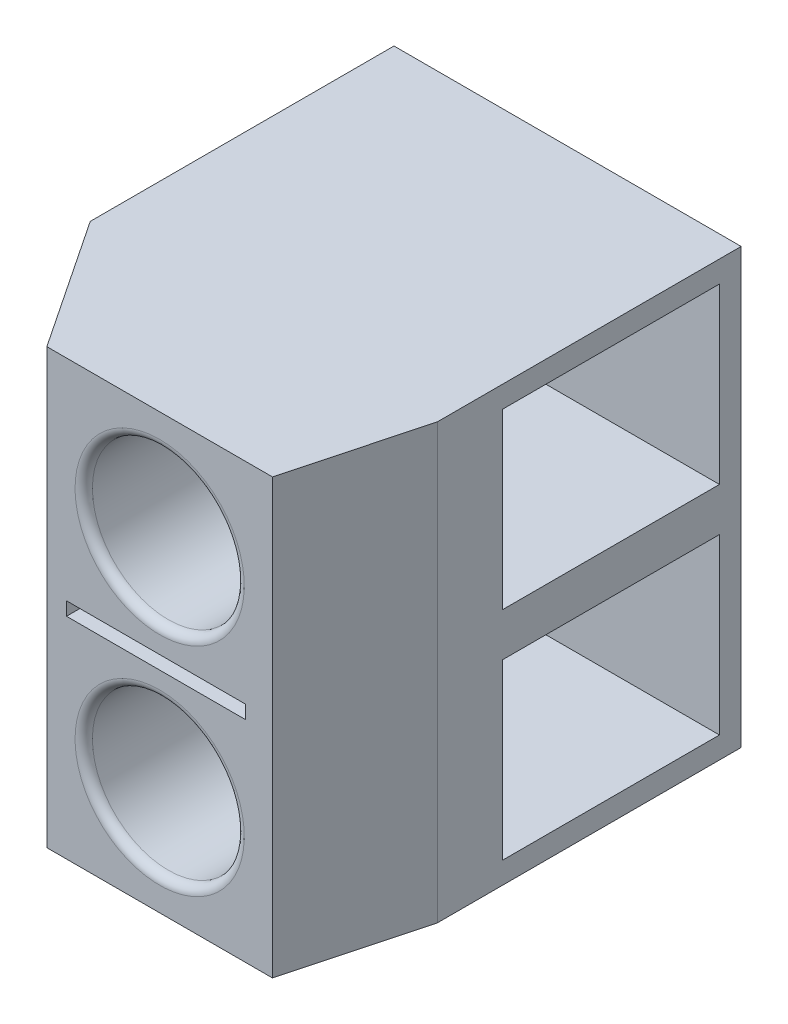
ISO-10303-21;
HEADER;
FILE_DESCRIPTION(('STEP AP214'),'2;1');
FILE_NAME('part.step','',(''),(''),'','','');
FILE_SCHEMA(('AUTOMOTIVE_DESIGN { 1 0 10303 214 1 1 1 1 }'));
ENDSEC;
DATA;
#1=APPLICATION_CONTEXT('core data for automotive mechanical design processes');
#2=APPLICATION_PROTOCOL_DEFINITION('international standard','automotive_design',2000,#1);
#3=PRODUCT_CONTEXT('',#1,'mechanical');
#4=PRODUCT('Part','Part','',(#3));
#5=PRODUCT_RELATED_PRODUCT_CATEGORY('part','',(#4));
#6=PRODUCT_DEFINITION_FORMATION('','',#4);
#7=PRODUCT_DEFINITION_CONTEXT('part definition',#1,'design');
#8=PRODUCT_DEFINITION('design','',#6,#7);
#9=PRODUCT_DEFINITION_SHAPE('','',#8);
#10=(LENGTH_UNIT() NAMED_UNIT(*) SI_UNIT(.MILLI.,.METRE.));
#11=(NAMED_UNIT(*) PLANE_ANGLE_UNIT() SI_UNIT($,.RADIAN.));
#12=(NAMED_UNIT(*) SI_UNIT($,.STERADIAN.) SOLID_ANGLE_UNIT());
#13=UNCERTAINTY_MEASURE_WITH_UNIT(LENGTH_MEASURE(1.E-05),#10,'distance_accuracy_value','');
#14=(GEOMETRIC_REPRESENTATION_CONTEXT(3) GLOBAL_UNCERTAINTY_ASSIGNED_CONTEXT((#13)) GLOBAL_UNIT_ASSIGNED_CONTEXT((#10,
#11,#12)) REPRESENTATION_CONTEXT('',''));
#15=CARTESIAN_POINT('',(0.,0.,0.));
#16=DIRECTION('',(0.,0.,1.));
#17=DIRECTION('',(1.,0.,0.));
#18=AXIS2_PLACEMENT_3D('',#15,#16,#17);
#19=CARTESIAN_POINT('',(6.57401180078,4.845554429064,-1.));
#20=DIRECTION('',(0.,0.,1.));
#21=DIRECTION('',(1.,0.,0.));
#22=AXIS2_PLACEMENT_3D('',#19,#20,#21);
#23=PLANE('',#22);
#24=DIRECTION('',(0.,1.,0.));
#25=VECTOR('',#24,1.);
#26=CARTESIAN_POINT('',(6.57401180078,4.845554429064,-1.));
#27=LINE('',#26,#25);
#28=CARTESIAN_POINT('',(6.57401180078,4.845554429064,-1.));
#29=VERTEX_POINT('',#28);
#30=CARTESIAN_POINT('',(6.57401180078,5.154445570936,-1.));
#31=VERTEX_POINT('',#30);
#32=EDGE_CURVE('E281',#29,#31,#27,.T.);
#33=ORIENTED_EDGE('',*,*,#32,.T.);
#34=DIRECTION('',(1.,0.,0.));
#35=VECTOR('',#34,1.);
#36=CARTESIAN_POINT('',(2.453062077991,5.154445570936,-1.));
#37=LINE('',#36,#35);
#38=CARTESIAN_POINT('',(2.453062077991,5.154445570936,-1.));
#39=VERTEX_POINT('',#38);
#40=EDGE_CURVE('E275',#31,#39,#37,.F.);
#41=ORIENTED_EDGE('',*,*,#40,.T.);
#42=DIRECTION('',(0.,1.,0.));
#43=VECTOR('',#42,1.);
#44=CARTESIAN_POINT('',(2.453062077991,5.154445570936,-1.));
#45=LINE('',#44,#43);
#46=CARTESIAN_POINT('',(2.453062077991,4.845554429064,-1.));
#47=VERTEX_POINT('',#46);
#48=EDGE_CURVE('E270',#39,#47,#45,.F.);
#49=ORIENTED_EDGE('',*,*,#48,.T.);
#50=DIRECTION('',(1.,0.,0.));
#51=VECTOR('',#50,1.);
#52=CARTESIAN_POINT('',(2.453062077991,4.845554429064,-1.));
#53=LINE('',#52,#51);
#54=EDGE_CURVE('E264',#47,#29,#53,.T.);
#55=ORIENTED_EDGE('',*,*,#54,.T.);
#56=EDGE_LOOP('',(#33,#41,#49,#55));
#57=FACE_BOUND('',#56,.T.);
#58=ADVANCED_FACE('F17',(#57),#23,.T.);
#59=CARTESIAN_POINT('',(4.6,7.5,-5.));
#60=DIRECTION('',(0.,0.,1.));
#61=DIRECTION('',(1.,0.,0.));
#62=AXIS2_PLACEMENT_3D('',#59,#60,#61);
#63=CYLINDRICAL_SURFACE('',#62,1.75);
#64=CARTESIAN_POINT('',(4.6,7.5,-0.2));
#65=DIRECTION('',(0.,0.,-1.));
#66=DIRECTION('',(0.,1.,0.));
#67=AXIS2_PLACEMENT_3D('',#64,#65,#66);
#68=CIRCLE('',#67,1.75);
#69=CARTESIAN_POINT('',(4.6,9.25,-0.2));
#70=VERTEX_POINT('',#69);
#71=EDGE_CURVE('E260',#70,#70,#68,.T.);
#72=ORIENTED_EDGE('',*,*,#71,.F.);
#73=EDGE_LOOP('',(#72));
#74=FACE_BOUND('',#73,.T.);
#75=CARTESIAN_POINT('',(4.6,7.5,-4.3));
#76=DIRECTION('',(0.,0.,1.));
#77=DIRECTION('',(1.,0.,0.));
#78=AXIS2_PLACEMENT_3D('',#75,#76,#77);
#79=CIRCLE('',#78,1.75);
#80=CARTESIAN_POINT('',(6.35,7.5,-4.3));
#81=VERTEX_POINT('',#80);
#82=EDGE_CURVE('E283',#81,#81,#79,.T.);
#83=ORIENTED_EDGE('',*,*,#82,.F.);
#84=EDGE_LOOP('',(#83));
#85=FACE_BOUND('',#84,.T.);
#86=ADVANCED_FACE('F722',(#74,#85),#63,.F.);
#87=CARTESIAN_POINT('',(4.6,2.5,-5.));
#88=DIRECTION('',(0.,0.,1.));
#89=DIRECTION('',(1.,0.,0.));
#90=AXIS2_PLACEMENT_3D('',#87,#88,#89);
#91=CYLINDRICAL_SURFACE('',#90,1.75);
#92=CARTESIAN_POINT('',(4.6,2.5,-0.2));
#93=DIRECTION('',(0.,0.,-1.));
#94=DIRECTION('',(0.,1.,0.));
#95=AXIS2_PLACEMENT_3D('',#92,#93,#94);
#96=CIRCLE('',#95,1.75);
#97=CARTESIAN_POINT('',(4.6,4.25,-0.2));
#98=VERTEX_POINT('',#97);
#99=EDGE_CURVE('E236',#98,#98,#96,.T.);
#100=ORIENTED_EDGE('',*,*,#99,.F.);
#101=EDGE_LOOP('',(#100));
#102=FACE_BOUND('',#101,.T.);
#103=CARTESIAN_POINT('',(4.6,2.5,-4.3));
#104=DIRECTION('',(0.,0.,1.));
#105=DIRECTION('',(1.,0.,0.));
#106=AXIS2_PLACEMENT_3D('',#103,#104,#105);
#107=CIRCLE('',#106,1.75);
#108=CARTESIAN_POINT('',(6.35,2.5,-4.3));
#109=VERTEX_POINT('',#108);
#110=EDGE_CURVE('E284',#109,#109,#107,.T.);
#111=ORIENTED_EDGE('',*,*,#110,.F.);
#112=EDGE_LOOP('',(#111));
#113=FACE_BOUND('',#112,.T.);
#114=ADVANCED_FACE('F713',(#102,#113),#91,.F.);
#115=CARTESIAN_POINT('',(4.6,7.5,-4.3));
#116=DIRECTION('',(0.,0.,1.));
#117=DIRECTION('',(1.,0.,0.));
#118=AXIS2_PLACEMENT_3D('',#115,#116,#117);
#119=TOROIDAL_SURFACE('',#118,1.95,0.200000000000001);
#120=ORIENTED_EDGE('',*,*,#82,.T.);
#121=EDGE_LOOP('',(#120));
#122=FACE_BOUND('',#121,.T.);
#123=CARTESIAN_POINT('',(4.6,7.5,-4.5));
#124=DIRECTION('',(0.,0.,1.));
#125=DIRECTION('',(1.,0.,0.));
#126=AXIS2_PLACEMENT_3D('',#123,#124,#125);
#127=CIRCLE('',#126,1.95);
#128=CARTESIAN_POINT('',(6.55,7.5,-4.5));
#129=VERTEX_POINT('',#128);
#130=EDGE_CURVE('E227',#129,#129,#127,.F.);
#131=ORIENTED_EDGE('',*,*,#130,.T.);
#132=EDGE_LOOP('',(#131));
#133=FACE_BOUND('',#132,.T.);
#134=ADVANCED_FACE('F704',(#122,#133),#119,.T.);
#135=CARTESIAN_POINT('',(4.6,2.5,-4.3));
#136=DIRECTION('',(0.,0.,1.));
#137=DIRECTION('',(1.,0.,0.));
#138=AXIS2_PLACEMENT_3D('',#135,#136,#137);
#139=TOROIDAL_SURFACE('',#138,1.95,0.2);
#140=ORIENTED_EDGE('',*,*,#110,.T.);
#141=EDGE_LOOP('',(#140));
#142=FACE_BOUND('',#141,.T.);
#143=CARTESIAN_POINT('',(4.6,2.5,-4.5));
#144=DIRECTION('',(0.,0.,1.));
#145=DIRECTION('',(1.,0.,0.));
#146=AXIS2_PLACEMENT_3D('',#143,#144,#145);
#147=CIRCLE('',#146,1.95);
#148=CARTESIAN_POINT('',(6.55,2.5,-4.5));
#149=VERTEX_POINT('',#148);
#150=EDGE_CURVE('E213',#149,#149,#147,.F.);
#151=ORIENTED_EDGE('',*,*,#150,.T.);
#152=EDGE_LOOP('',(#151));
#153=FACE_BOUND('',#152,.T.);
#154=ADVANCED_FACE('F695',(#142,#153),#139,.T.);
#155=CARTESIAN_POINT('',(1.7,7.5,-8.));
#156=DIRECTION('',(0.,0.,1.));
#157=DIRECTION('',(1.,0.,0.));
#158=AXIS2_PLACEMENT_3D('',#155,#156,#157);
#159=CYLINDRICAL_SURFACE('',#158,0.300785403025);
#160=CARTESIAN_POINT('',(1.7,7.5,-4.5));
#161=DIRECTION('',(0.,0.,1.));
#162=DIRECTION('',(1.,0.,0.));
#163=AXIS2_PLACEMENT_3D('',#160,#161,#162);
#164=CIRCLE('',#163,0.300785403025);
#165=CARTESIAN_POINT('',(2.000785403025,7.5,-4.5));
#166=VERTEX_POINT('',#165);
#167=EDGE_CURVE('E230',#166,#166,#164,.F.);
#168=ORIENTED_EDGE('',*,*,#167,.T.);
#169=EDGE_LOOP('',(#168));
#170=FACE_BOUND('',#169,.T.);
#171=CARTESIAN_POINT('',(1.7,7.5,-0.45000000000027));
#172=DIRECTION('',(0.832050294337997,0.,-0.554700196224998));
#173=DIRECTION('',(0.554700196224998,0.,0.832050294337998));
#174=AXIS2_PLACEMENT_3D('',#171,#172,#173);
#175=ELLIPSE('',#174,0.542248596759095,0.300785403025);
#176=CARTESIAN_POINT('',(2.,7.47827769181436,0.));
#177=VERTEX_POINT('',#176);
#178=CARTESIAN_POINT('',(2.,7.52172230818564,0.));
#179=VERTEX_POINT('',#178);
#180=EDGE_CURVE('E21',#177,#179,#175,.T.);
#181=ORIENTED_EDGE('',*,*,#180,.F.);
#182=CARTESIAN_POINT('',(1.7,7.5,0.));
#183=DIRECTION('',(0.,0.,1.));
#184=DIRECTION('',(1.,0.,0.));
#185=AXIS2_PLACEMENT_3D('',#182,#183,#184);
#186=CIRCLE('',#185,0.300785403025);
#187=EDGE_CURVE('E165',#177,#179,#186,.T.);
#188=ORIENTED_EDGE('',*,*,#187,.T.);
#189=EDGE_LOOP('',(#181,#188));
#190=FACE_BOUND('',#189,.T.);
#191=ADVANCED_FACE('F313',(#170,#190),#159,.F.);
#192=CARTESIAN_POINT('',(2.453062077991,5.154445570936,-1.));
#193=DIRECTION('',(0.,1.,0.));
#194=DIRECTION('',(0.,0.,1.));
#195=AXIS2_PLACEMENT_3D('',#192,#193,#194);
#196=PLANE('',#195);
#197=ORIENTED_EDGE('',*,*,#40,.F.);
#198=DIRECTION('',(0.,0.,-1.));
#199=VECTOR('',#198,1.);
#200=CARTESIAN_POINT('',(6.57401180078,5.154445570936,-1.));
#201=LINE('',#200,#199);
#202=CARTESIAN_POINT('',(6.57401180078,5.154445570936,0.));
#203=VERTEX_POINT('',#202);
#204=EDGE_CURVE('E257',#31,#203,#201,.F.);
#205=ORIENTED_EDGE('',*,*,#204,.T.);
#206=DIRECTION('',(-1.,0.,0.));
#207=VECTOR('',#206,1.);
#208=CARTESIAN_POINT('',(0.,5.154445570936,0.));
#209=LINE('',#208,#207);
#210=CARTESIAN_POINT('',(2.453062077991,5.154445570936,0.));
#211=VERTEX_POINT('',#210);
#212=EDGE_CURVE('E206',#203,#211,#209,.T.);
#213=ORIENTED_EDGE('',*,*,#212,.T.);
#214=DIRECTION('',(0.,0.,1.));
#215=VECTOR('',#214,1.);
#216=CARTESIAN_POINT('',(2.453062077991,5.154445570936,-1.));
#217=LINE('',#216,#215);
#218=EDGE_CURVE('E272',#211,#39,#217,.F.);
#219=ORIENTED_EDGE('',*,*,#218,.T.);
#220=EDGE_LOOP('',(#197,#205,#213,#219));
#221=FACE_BOUND('',#220,.T.);
#222=ADVANCED_FACE('F677',(#221),#196,.F.);
#223=CARTESIAN_POINT('',(2.453062077991,5.154445570936,-1.));
#224=DIRECTION('',(-1.,0.,0.));
#225=DIRECTION('',(0.,0.,1.));
#226=AXIS2_PLACEMENT_3D('',#223,#224,#225);
#227=PLANE('',#226);
#228=ORIENTED_EDGE('',*,*,#48,.F.);
#229=ORIENTED_EDGE('',*,*,#218,.F.);
#230=DIRECTION('',(0.,1.,0.));
#231=VECTOR('',#230,1.);
#232=CARTESIAN_POINT('',(2.453062077991,10.,0.));
#233=LINE('',#232,#231);
#234=CARTESIAN_POINT('',(2.453062077991,4.845554429064,0.));
#235=VERTEX_POINT('',#234);
#236=EDGE_CURVE('E203',#211,#235,#233,.F.);
#237=ORIENTED_EDGE('',*,*,#236,.T.);
#238=DIRECTION('',(0.,0.,-1.));
#239=VECTOR('',#238,1.);
#240=CARTESIAN_POINT('',(2.453062077991,4.845554429064,-1.));
#241=LINE('',#240,#239);
#242=EDGE_CURVE('E267',#235,#47,#241,.T.);
#243=ORIENTED_EDGE('',*,*,#242,.T.);
#244=EDGE_LOOP('',(#228,#229,#237,#243));
#245=FACE_BOUND('',#244,.T.);
#246=ADVANCED_FACE('F667',(#245),#227,.F.);
#247=CARTESIAN_POINT('',(2.453062077991,4.845554429064,-1.));
#248=DIRECTION('',(0.,-1.,0.));
#249=DIRECTION('',(0.,0.,-1.));
#250=AXIS2_PLACEMENT_3D('',#247,#248,#249);
#251=PLANE('',#250);
#252=ORIENTED_EDGE('',*,*,#54,.F.);
#253=ORIENTED_EDGE('',*,*,#242,.F.);
#254=DIRECTION('',(-1.,0.,0.));
#255=VECTOR('',#254,1.);
#256=CARTESIAN_POINT('',(0.,4.845554429064,0.));
#257=LINE('',#256,#255);
#258=CARTESIAN_POINT('',(6.57401180078,4.845554429064,0.));
#259=VERTEX_POINT('',#258);
#260=EDGE_CURVE('E200',#235,#259,#257,.F.);
#261=ORIENTED_EDGE('',*,*,#260,.T.);
#262=DIRECTION('',(0.,0.,-1.));
#263=VECTOR('',#262,1.);
#264=CARTESIAN_POINT('',(6.57401180078,4.845554429064,-1.));
#265=LINE('',#264,#263);
#266=EDGE_CURVE('E261',#259,#29,#265,.T.);
#267=ORIENTED_EDGE('',*,*,#266,.T.);
#268=EDGE_LOOP('',(#252,#253,#261,#267));
#269=FACE_BOUND('',#268,.T.);
#270=ADVANCED_FACE('F657',(#269),#251,.F.);
#271=CARTESIAN_POINT('',(6.57401180078,5.154445570936,-1.));
#272=DIRECTION('',(1.,0.,0.));
#273=DIRECTION('',(0.,0.,-1.));
#274=AXIS2_PLACEMENT_3D('',#271,#272,#273);
#275=PLANE('',#274);
#276=ORIENTED_EDGE('',*,*,#32,.F.);
#277=ORIENTED_EDGE('',*,*,#266,.F.);
#278=DIRECTION('',(0.,1.,0.));
#279=VECTOR('',#278,1.);
#280=CARTESIAN_POINT('',(6.57401180078,10.,0.));
#281=LINE('',#280,#279);
#282=EDGE_CURVE('E196',#259,#203,#281,.T.);
#283=ORIENTED_EDGE('',*,*,#282,.T.);
#284=ORIENTED_EDGE('',*,*,#204,.F.);
#285=EDGE_LOOP('',(#276,#277,#283,#284));
#286=FACE_BOUND('',#285,.T.);
#287=ADVANCED_FACE('F648',(#286),#275,.F.);
#288=CARTESIAN_POINT('',(4.6,7.5,-0.2));
#289=DIRECTION('',(0.,0.,-1.));
#290=DIRECTION('',(0.,1.,0.));
#291=AXIS2_PLACEMENT_3D('',#288,#289,#290);
#292=TOROIDAL_SURFACE('',#291,1.95,0.2);
#293=ORIENTED_EDGE('',*,*,#71,.T.);
#294=EDGE_LOOP('',(#293));
#295=FACE_BOUND('',#294,.T.);
#296=CARTESIAN_POINT('',(4.6,7.5,0.));
#297=DIRECTION('',(0.,0.,-1.));
#298=DIRECTION('',(0.,1.,0.));
#299=AXIS2_PLACEMENT_3D('',#296,#297,#298);
#300=CIRCLE('',#299,1.95);
#301=CARTESIAN_POINT('',(4.6,9.45,0.));
#302=VERTEX_POINT('',#301);
#303=EDGE_CURVE('E199',#302,#302,#300,.F.);
#304=ORIENTED_EDGE('',*,*,#303,.T.);
#305=EDGE_LOOP('',(#304));
#306=FACE_BOUND('',#305,.T.);
#307=ADVANCED_FACE('F639',(#295,#306),#292,.T.);
#308=CARTESIAN_POINT('',(4.6,2.5,-0.2));
#309=DIRECTION('',(0.,0.,-1.));
#310=DIRECTION('',(0.,1.,0.));
#311=AXIS2_PLACEMENT_3D('',#308,#309,#310);
#312=TOROIDAL_SURFACE('',#311,1.95,0.2);
#313=ORIENTED_EDGE('',*,*,#99,.T.);
#314=EDGE_LOOP('',(#313));
#315=FACE_BOUND('',#314,.T.);
#316=CARTESIAN_POINT('',(4.6,2.5,0.));
#317=DIRECTION('',(0.,0.,-1.));
#318=DIRECTION('',(0.,1.,0.));
#319=AXIS2_PLACEMENT_3D('',#316,#317,#318);
#320=CIRCLE('',#319,1.95);
#321=CARTESIAN_POINT('',(4.6,4.45,0.));
#322=VERTEX_POINT('',#321);
#323=EDGE_CURVE('E195',#322,#322,#320,.F.);
#324=ORIENTED_EDGE('',*,*,#323,.T.);
#325=EDGE_LOOP('',(#324));
#326=FACE_BOUND('',#325,.T.);
#327=ADVANCED_FACE('F19',(#315,#326),#312,.T.);
#328=CARTESIAN_POINT('',(1.7,2.5,-8.));
#329=DIRECTION('',(0.,0.,1.));
#330=DIRECTION('',(1.,0.,0.));
#331=AXIS2_PLACEMENT_3D('',#328,#329,#330);
#332=CYLINDRICAL_SURFACE('',#331,0.300785403025);
#333=CARTESIAN_POINT('',(1.7,2.5,0.));
#334=DIRECTION('',(0.,0.,1.));
#335=DIRECTION('',(1.,0.,0.));
#336=AXIS2_PLACEMENT_3D('',#333,#334,#335);
#337=CIRCLE('',#336,0.300785403025);
#338=CARTESIAN_POINT('',(2.,2.47827769181436,0.));
#339=VERTEX_POINT('',#338);
#340=CARTESIAN_POINT('',(2.,2.52172230818564,0.));
#341=VERTEX_POINT('',#340);
#342=EDGE_CURVE('E156',#339,#341,#337,.T.);
#343=ORIENTED_EDGE('',*,*,#342,.T.);
#344=CARTESIAN_POINT('',(1.7,2.5,-0.45000000000027));
#345=DIRECTION('',(0.832050294337997,0.,-0.554700196224998));
#346=DIRECTION('',(0.554700196224998,0.,0.832050294337998));
#347=AXIS2_PLACEMENT_3D('',#344,#345,#346);
#348=ELLIPSE('',#347,0.542248596759095,0.300785403025);
#349=EDGE_CURVE('E160',#341,#339,#348,.F.);
#350=ORIENTED_EDGE('',*,*,#349,.T.);
#351=EDGE_LOOP('',(#343,#350));
#352=FACE_BOUND('',#351,.T.);
#353=CARTESIAN_POINT('',(1.7,2.5,-4.5));
#354=DIRECTION('',(0.,0.,1.));
#355=DIRECTION('',(1.,0.,0.));
#356=AXIS2_PLACEMENT_3D('',#353,#354,#355);
#357=CIRCLE('',#356,0.300785403025);
#358=CARTESIAN_POINT('',(2.000785403025,2.5,-4.5));
#359=VERTEX_POINT('',#358);
#360=EDGE_CURVE('E216',#359,#359,#357,.F.);
#361=ORIENTED_EDGE('',*,*,#360,.T.);
#362=EDGE_LOOP('',(#361));
#363=FACE_BOUND('',#362,.T.);
#364=ADVANCED_FACE('F158',(#352,#363),#332,.F.);
#365=CARTESIAN_POINT('',(1.,0.5,-9.5));
#366=DIRECTION('',(1.,0.,0.));
#367=DIRECTION('',(0.,0.,-1.));
#368=AXIS2_PLACEMENT_3D('',#365,#366,#367);
#369=PLANE('',#368);
#370=DIRECTION('',(0.,1.,0.));
#371=VECTOR('',#370,1.);
#372=CARTESIAN_POINT('',(1.,4.5,-9.5));
#373=LINE('',#372,#371);
#374=CARTESIAN_POINT('',(1.,0.5,-9.5));
#375=VERTEX_POINT('',#374);
#376=CARTESIAN_POINT('',(1.,4.5,-9.5));
#377=VERTEX_POINT('',#376);
#378=EDGE_CURVE('E183',#375,#377,#373,.T.);
#379=ORIENTED_EDGE('',*,*,#378,.T.);
#380=DIRECTION('',(0.,0.,1.));
#381=VECTOR('',#380,1.);
#382=CARTESIAN_POINT('',(1.,4.5,-4.5));
#383=LINE('',#382,#381);
#384=CARTESIAN_POINT('',(1.,4.5,-4.5));
#385=VERTEX_POINT('',#384);
#386=EDGE_CURVE('E220',#377,#385,#383,.T.);
#387=ORIENTED_EDGE('',*,*,#386,.T.);
#388=DIRECTION('',(0.,-1.,0.));
#389=VECTOR('',#388,1.);
#390=CARTESIAN_POINT('',(1.,4.5,-4.5));
#391=LINE('',#390,#389);
#392=CARTESIAN_POINT('',(1.,0.5,-4.5));
#393=VERTEX_POINT('',#392);
#394=EDGE_CURVE('E214',#385,#393,#391,.T.);
#395=ORIENTED_EDGE('',*,*,#394,.T.);
#396=DIRECTION('',(0.,0.,-1.));
#397=VECTOR('',#396,1.);
#398=CARTESIAN_POINT('',(1.,0.5,-4.5));
#399=LINE('',#398,#397);
#400=EDGE_CURVE('E166',#393,#375,#399,.T.);
#401=ORIENTED_EDGE('',*,*,#400,.T.);
#402=EDGE_LOOP('',(#379,#387,#395,#401));
#403=FACE_BOUND('',#402,.T.);
#404=ADVANCED_FACE('F360',(#403),#369,.T.);
#405=CARTESIAN_POINT('',(1.,5.5,-9.5));
#406=DIRECTION('',(1.,0.,0.));
#407=DIRECTION('',(0.,0.,-1.));
#408=AXIS2_PLACEMENT_3D('',#405,#406,#407);
#409=PLANE('',#408);
#410=DIRECTION('',(0.,1.,0.));
#411=VECTOR('',#410,1.);
#412=CARTESIAN_POINT('',(1.,9.5,-9.5));
#413=LINE('',#412,#411);
#414=CARTESIAN_POINT('',(1.,5.5,-9.5));
#415=VERTEX_POINT('',#414);
#416=CARTESIAN_POINT('',(1.,9.5,-9.5));
#417=VERTEX_POINT('',#416);
#418=EDGE_CURVE('E349',#415,#417,#413,.T.);
#419=ORIENTED_EDGE('',*,*,#418,.T.);
#420=DIRECTION('',(0.,0.,1.));
#421=VECTOR('',#420,1.);
#422=CARTESIAN_POINT('',(1.,9.5,-4.5));
#423=LINE('',#422,#421);
#424=CARTESIAN_POINT('',(1.,9.5,-4.5));
#425=VERTEX_POINT('',#424);
#426=EDGE_CURVE('E234',#417,#425,#423,.T.);
#427=ORIENTED_EDGE('',*,*,#426,.T.);
#428=DIRECTION('',(0.,-1.,0.));
#429=VECTOR('',#428,1.);
#430=CARTESIAN_POINT('',(1.,9.5,-4.5));
#431=LINE('',#430,#429);
#432=CARTESIAN_POINT('',(1.,5.5,-4.5));
#433=VERTEX_POINT('',#432);
#434=EDGE_CURVE('E228',#425,#433,#431,.T.);
#435=ORIENTED_EDGE('',*,*,#434,.T.);
#436=DIRECTION('',(0.,0.,-1.));
#437=VECTOR('',#436,1.);
#438=CARTESIAN_POINT('',(1.,5.5,-4.5));
#439=LINE('',#438,#437);
#440=EDGE_CURVE('E222',#433,#415,#439,.T.);
#441=ORIENTED_EDGE('',*,*,#440,.T.);
#442=EDGE_LOOP('',(#419,#427,#435,#441));
#443=FACE_BOUND('',#442,.T.);
#444=ADVANCED_FACE('F394',(#443),#409,.T.);
#445=CARTESIAN_POINT('',(1.,9.5,-4.5));
#446=DIRECTION('',(0.,1.,0.));
#447=DIRECTION('',(0.,0.,1.));
#448=AXIS2_PLACEMENT_3D('',#445,#446,#447);
#449=PLANE('',#448);
#450=ORIENTED_EDGE('',*,*,#426,.F.);
#451=DIRECTION('',(1.,0.,0.));
#452=VECTOR('',#451,1.);
#453=CARTESIAN_POINT('',(1.,9.5,-9.5));
#454=LINE('',#453,#452);
#455=CARTESIAN_POINT('',(8.,9.5,-9.5));
#456=VERTEX_POINT('',#455);
#457=EDGE_CURVE('E332',#417,#456,#454,.T.);
#458=ORIENTED_EDGE('',*,*,#457,.T.);
#459=DIRECTION('',(0.,0.,1.));
#460=VECTOR('',#459,1.);
#461=CARTESIAN_POINT('',(8.,9.5,0.));
#462=LINE('',#461,#460);
#463=CARTESIAN_POINT('',(8.,9.5,-4.5));
#464=VERTEX_POINT('',#463);
#465=EDGE_CURVE('E331',#456,#464,#462,.T.);
#466=ORIENTED_EDGE('',*,*,#465,.T.);
#467=DIRECTION('',(1.,0.,0.));
#468=VECTOR('',#467,1.);
#469=CARTESIAN_POINT('',(1.,9.5,-4.5));
#470=LINE('',#469,#468);
#471=EDGE_CURVE('E231',#464,#425,#470,.F.);
#472=ORIENTED_EDGE('',*,*,#471,.T.);
#473=EDGE_LOOP('',(#450,#458,#466,#472));
#474=FACE_BOUND('',#473,.T.);
#475=ADVANCED_FACE('F319',(#474),#449,.F.);
#476=CARTESIAN_POINT('',(1.,9.5,-4.5));
#477=DIRECTION('',(0.,0.,1.));
#478=DIRECTION('',(0.,-1.,0.));
#479=AXIS2_PLACEMENT_3D('',#476,#477,#478);
#480=PLANE('',#479);
#481=ORIENTED_EDGE('',*,*,#130,.F.);
#482=EDGE_LOOP('',(#481));
#483=FACE_BOUND('',#482,.T.);
#484=ORIENTED_EDGE('',*,*,#167,.F.);
#485=EDGE_LOOP('',(#484));
#486=FACE_BOUND('',#485,.T.);
#487=ORIENTED_EDGE('',*,*,#434,.F.);
#488=ORIENTED_EDGE('',*,*,#471,.F.);
#489=DIRECTION('',(0.,1.,0.));
#490=VECTOR('',#489,1.);
#491=CARTESIAN_POINT('',(8.,10.,-4.5));
#492=LINE('',#491,#490);
#493=CARTESIAN_POINT('',(8.,5.5,-4.5));
#494=VERTEX_POINT('',#493);
#495=EDGE_CURVE('E336',#464,#494,#492,.F.);
#496=ORIENTED_EDGE('',*,*,#495,.T.);
#497=DIRECTION('',(1.,0.,0.));
#498=VECTOR('',#497,1.);
#499=CARTESIAN_POINT('',(1.,5.5,-4.5));
#500=LINE('',#499,#498);
#501=EDGE_CURVE('E224',#494,#433,#500,.F.);
#502=ORIENTED_EDGE('',*,*,#501,.T.);
#503=EDGE_LOOP('',(#487,#488,#496,#502));
#504=FACE_BOUND('',#503,.T.);
#505=ADVANCED_FACE('F315',(#483,#486,#504),#480,.F.);
#506=CARTESIAN_POINT('',(1.,5.5,-4.5));
#507=DIRECTION('',(0.,-1.,0.));
#508=DIRECTION('',(0.,0.,-1.));
#509=AXIS2_PLACEMENT_3D('',#506,#507,#508);
#510=PLANE('',#509);
#511=ORIENTED_EDGE('',*,*,#440,.F.);
#512=ORIENTED_EDGE('',*,*,#501,.F.);
#513=DIRECTION('',(0.,0.,1.));
#514=VECTOR('',#513,1.);
#515=CARTESIAN_POINT('',(8.,5.5,0.));
#516=LINE('',#515,#514);
#517=CARTESIAN_POINT('',(8.,5.5,-9.5));
#518=VERTEX_POINT('',#517);
#519=EDGE_CURVE('E339',#494,#518,#516,.F.);
#520=ORIENTED_EDGE('',*,*,#519,.T.);
#521=DIRECTION('',(1.,0.,0.));
#522=VECTOR('',#521,1.);
#523=CARTESIAN_POINT('',(1.,5.5,-9.5));
#524=LINE('',#523,#522);
#525=EDGE_CURVE('E352',#518,#415,#524,.F.);
#526=ORIENTED_EDGE('',*,*,#525,.T.);
#527=EDGE_LOOP('',(#511,#512,#520,#526));
#528=FACE_BOUND('',#527,.T.);
#529=ADVANCED_FACE('F318',(#528),#510,.F.);
#530=CARTESIAN_POINT('',(1.,4.5,-4.5));
#531=DIRECTION('',(0.,1.,0.));
#532=DIRECTION('',(0.,0.,1.));
#533=AXIS2_PLACEMENT_3D('',#530,#531,#532);
#534=PLANE('',#533);
#535=ORIENTED_EDGE('',*,*,#386,.F.);
#536=DIRECTION('',(-1.,0.,0.));
#537=VECTOR('',#536,1.);
#538=CARTESIAN_POINT('',(1.,4.5,-9.5));
#539=LINE('',#538,#537);
#540=CARTESIAN_POINT('',(8.,4.5,-9.5));
#541=VERTEX_POINT('',#540);
#542=EDGE_CURVE('E355',#377,#541,#539,.F.);
#543=ORIENTED_EDGE('',*,*,#542,.T.);
#544=DIRECTION('',(0.,0.,1.));
#545=VECTOR('',#544,1.);
#546=CARTESIAN_POINT('',(8.,4.5,0.));
#547=LINE('',#546,#545);
#548=CARTESIAN_POINT('',(8.,4.5,-4.5));
#549=VERTEX_POINT('',#548);
#550=EDGE_CURVE('E379',#541,#549,#547,.T.);
#551=ORIENTED_EDGE('',*,*,#550,.T.);
#552=DIRECTION('',(1.,0.,0.));
#553=VECTOR('',#552,1.);
#554=CARTESIAN_POINT('',(1.,4.5,-4.5));
#555=LINE('',#554,#553);
#556=EDGE_CURVE('E217',#549,#385,#555,.F.);
#557=ORIENTED_EDGE('',*,*,#556,.T.);
#558=EDGE_LOOP('',(#535,#543,#551,#557));
#559=FACE_BOUND('',#558,.T.);
#560=ADVANCED_FACE('F454',(#559),#534,.F.);
#561=CARTESIAN_POINT('',(1.,4.5,-4.5));
#562=DIRECTION('',(0.,0.,1.));
#563=DIRECTION('',(0.,-1.,0.));
#564=AXIS2_PLACEMENT_3D('',#561,#562,#563);
#565=PLANE('',#564);
#566=ORIENTED_EDGE('',*,*,#150,.F.);
#567=EDGE_LOOP('',(#566));
#568=FACE_BOUND('',#567,.T.);
#569=ORIENTED_EDGE('',*,*,#360,.F.);
#570=EDGE_LOOP('',(#569));
#571=FACE_BOUND('',#570,.T.);
#572=ORIENTED_EDGE('',*,*,#394,.F.);
#573=ORIENTED_EDGE('',*,*,#556,.F.);
#574=DIRECTION('',(0.,1.,0.));
#575=VECTOR('',#574,1.);
#576=CARTESIAN_POINT('',(8.,10.,-4.5));
#577=LINE('',#576,#575);
#578=CARTESIAN_POINT('',(8.,0.5,-4.5));
#579=VERTEX_POINT('',#578);
#580=EDGE_CURVE('E376',#549,#579,#577,.F.);
#581=ORIENTED_EDGE('',*,*,#580,.T.);
#582=DIRECTION('',(1.,0.,0.));
#583=VECTOR('',#582,1.);
#584=CARTESIAN_POINT('',(1.,0.5,-4.5));
#585=LINE('',#584,#583);
#586=EDGE_CURVE('E210',#579,#393,#585,.F.);
#587=ORIENTED_EDGE('',*,*,#586,.T.);
#588=EDGE_LOOP('',(#572,#573,#581,#587));
#589=FACE_BOUND('',#588,.T.);
#590=ADVANCED_FACE('F451',(#568,#571,#589),#565,.F.);
#591=CARTESIAN_POINT('',(1.,0.5,-4.5));
#592=DIRECTION('',(0.,-1.,0.));
#593=DIRECTION('',(0.,0.,-1.));
#594=AXIS2_PLACEMENT_3D('',#591,#592,#593);
#595=PLANE('',#594);
#596=ORIENTED_EDGE('',*,*,#400,.F.);
#597=ORIENTED_EDGE('',*,*,#586,.F.);
#598=DIRECTION('',(0.,0.,1.));
#599=VECTOR('',#598,1.);
#600=CARTESIAN_POINT('',(8.,0.5,0.));
#601=LINE('',#600,#599);
#602=CARTESIAN_POINT('',(8.,0.5,-9.5));
#603=VERTEX_POINT('',#602);
#604=EDGE_CURVE('E372',#579,#603,#601,.F.);
#605=ORIENTED_EDGE('',*,*,#604,.T.);
#606=DIRECTION('',(-1.,0.,0.));
#607=VECTOR('',#606,1.);
#608=CARTESIAN_POINT('',(1.,0.5,-9.5));
#609=LINE('',#608,#607);
#610=EDGE_CURVE('E179',#603,#375,#609,.T.);
#611=ORIENTED_EDGE('',*,*,#610,.T.);
#612=EDGE_LOOP('',(#596,#597,#605,#611));
#613=FACE_BOUND('',#612,.T.);
#614=ADVANCED_FACE('F370',(#613),#595,.F.);
#615=CARTESIAN_POINT('',(0.,10.,0.));
#616=DIRECTION('',(0.,0.,-1.));
#617=DIRECTION('',(-1.,0.,0.));
#618=AXIS2_PLACEMENT_3D('',#615,#616,#617);
#619=PLANE('',#618);
#620=ORIENTED_EDGE('',*,*,#323,.F.);
#621=EDGE_LOOP('',(#620));
#622=FACE_BOUND('',#621,.T.);
#623=ORIENTED_EDGE('',*,*,#303,.F.);
#624=EDGE_LOOP('',(#623));
#625=FACE_BOUND('',#624,.T.);
#626=ORIENTED_EDGE('',*,*,#260,.F.);
#627=ORIENTED_EDGE('',*,*,#236,.F.);
#628=ORIENTED_EDGE('',*,*,#212,.F.);
#629=ORIENTED_EDGE('',*,*,#282,.F.);
#630=EDGE_LOOP('',(#626,#627,#628,#629));
#631=FACE_BOUND('',#630,.T.);
#632=DIRECTION('',(1.,0.,0.));
#633=VECTOR('',#632,1.);
#634=CARTESIAN_POINT('',(0.,10.,0.));
#635=LINE('',#634,#633);
#636=CARTESIAN_POINT('',(7.2,10.,0.));
#637=VERTEX_POINT('',#636);
#638=CARTESIAN_POINT('',(2.,10.,0.));
#639=VERTEX_POINT('',#638);
#640=EDGE_CURVE('E240',#637,#639,#635,.F.);
#641=ORIENTED_EDGE('',*,*,#640,.T.);
#642=DIRECTION('',(0.,1.,0.));
#643=VECTOR('',#642,1.);
#644=CARTESIAN_POINT('',(2.,10.,0.));
#645=LINE('',#644,#643);
#646=EDGE_CURVE('E180',#639,#179,#645,.F.);
#647=ORIENTED_EDGE('',*,*,#646,.T.);
#648=ORIENTED_EDGE('',*,*,#187,.F.);
#649=DIRECTION('',(0.,1.,0.));
#650=VECTOR('',#649,1.);
#651=CARTESIAN_POINT('',(2.,10.,0.));
#652=LINE('',#651,#650);
#653=EDGE_CURVE('E171',#177,#341,#652,.F.);
#654=ORIENTED_EDGE('',*,*,#653,.T.);
#655=ORIENTED_EDGE('',*,*,#342,.F.);
#656=DIRECTION('',(0.,1.,0.));
#657=VECTOR('',#656,1.);
#658=CARTESIAN_POINT('',(2.,10.,0.));
#659=LINE('',#658,#657);
#660=CARTESIAN_POINT('',(2.,0.,0.));
#661=VERTEX_POINT('',#660);
#662=EDGE_CURVE('E173',#339,#661,#659,.F.);
#663=ORIENTED_EDGE('',*,*,#662,.T.);
#664=DIRECTION('',(1.,0.,0.));
#665=VECTOR('',#664,1.);
#666=CARTESIAN_POINT('',(0.,0.,0.));
#667=LINE('',#666,#665);
#668=CARTESIAN_POINT('',(7.2,0.,0.));
#669=VERTEX_POINT('',#668);
#670=EDGE_CURVE('E247',#669,#661,#667,.F.);
#671=ORIENTED_EDGE('',*,*,#670,.F.);
#672=DIRECTION('',(0.,1.,0.));
#673=VECTOR('',#672,1.);
#674=CARTESIAN_POINT('',(7.2,10.000025,0.));
#675=LINE('',#674,#673);
#676=EDGE_CURVE('E174',#669,#637,#675,.T.);
#677=ORIENTED_EDGE('',*,*,#676,.T.);
#678=EDGE_LOOP('',(#641,#647,#648,#654,#655,#663,#671,#677));
#679=FACE_BOUND('',#678,.T.);
#680=ADVANCED_FACE('F177',(#622,#625,#631,#679),#619,.F.);
#681=CARTESIAN_POINT('',(7.2,10.000025,0.));
#682=DIRECTION('',(-0.966234939601313,0.,-0.257662650560083));
#683=DIRECTION('',(-0.257662650560083,0.,0.966234939601313));
#684=AXIS2_PLACEMENT_3D('',#681,#682,#683);
#685=PLANE('',#684);
#686=DIRECTION('',(0.,1.,0.));
#687=VECTOR('',#686,1.);
#688=CARTESIAN_POINT('',(8.,10.,-3.));
#689=LINE('',#688,#687);
#690=CARTESIAN_POINT('',(7.99999999999981,0.,-3.00000000000005));
#691=VERTEX_POINT('',#690);
#692=CARTESIAN_POINT('',(7.99999999999981,10.000000625,-3.00000000000005));
#693=VERTEX_POINT('',#692);
#694=EDGE_CURVE('E337',#691,#693,#689,.T.);
#695=ORIENTED_EDGE('',*,*,#694,.T.);
#696=DIRECTION('',(-0.257662650560332,0.,0.966234939601246));
#697=VECTOR('',#696,1.);
#698=CARTESIAN_POINT('',(8.,10.,-3.));
#699=LINE('',#698,#697);
#700=EDGE_CURVE('E842',#693,#637,#699,.T.);
#701=ORIENTED_EDGE('',*,*,#700,.T.);
#702=ORIENTED_EDGE('',*,*,#676,.F.);
#703=DIRECTION('',(-0.257662650560332,0.,0.966234939601246));
#704=VECTOR('',#703,1.);
#705=CARTESIAN_POINT('',(8.,0.,-3.));
#706=LINE('',#705,#704);
#707=EDGE_CURVE('E250',#691,#669,#706,.T.);
#708=ORIENTED_EDGE('',*,*,#707,.F.);
#709=EDGE_LOOP('',(#695,#701,#702,#708));
#710=FACE_BOUND('',#709,.T.);
#711=ADVANCED_FACE('F442',(#710),#685,.F.);
#712=CARTESIAN_POINT('',(2.,10.,0.));
#713=DIRECTION('',(0.832050294337997,0.,-0.554700196224998));
#714=DIRECTION('',(-0.554700196224998,0.,-0.832050294337997));
#715=AXIS2_PLACEMENT_3D('',#712,#713,#714);
#716=PLANE('',#715);
#717=ORIENTED_EDGE('',*,*,#653,.F.);
#718=ORIENTED_EDGE('',*,*,#180,.T.);
#719=ORIENTED_EDGE('',*,*,#646,.F.);
#720=DIRECTION('',(-0.554700196225229,0.,-0.832050294337844));
#721=VECTOR('',#720,1.);
#722=CARTESIAN_POINT('',(2.,10.,0.));
#723=LINE('',#722,#721);
#724=CARTESIAN_POINT('',(2.07489190759413E-13,10.,-3.00000000000014));
#725=VERTEX_POINT('',#724);
#726=EDGE_CURVE('E237',#639,#725,#723,.T.);
#727=ORIENTED_EDGE('',*,*,#726,.T.);
#728=DIRECTION('',(0.,1.,0.));
#729=VECTOR('',#728,1.);
#730=CARTESIAN_POINT('',(0.,10.,-3.));
#731=LINE('',#730,#729);
#732=CARTESIAN_POINT('',(2.07597610976662E-13,0.,-3.00000000000014));
#733=VERTEX_POINT('',#732);
#734=EDGE_CURVE('E298',#725,#733,#731,.F.);
#735=ORIENTED_EDGE('',*,*,#734,.T.);
#736=DIRECTION('',(-0.554700196225229,0.,-0.832050294337844));
#737=VECTOR('',#736,1.);
#738=CARTESIAN_POINT('',(2.,0.,0.));
#739=LINE('',#738,#737);
#740=EDGE_CURVE('E249',#661,#733,#739,.T.);
#741=ORIENTED_EDGE('',*,*,#740,.F.);
#742=ORIENTED_EDGE('',*,*,#662,.F.);
#743=ORIENTED_EDGE('',*,*,#349,.F.);
#744=EDGE_LOOP('',(#717,#718,#719,#727,#735,#741,#742,#743));
#745=FACE_BOUND('',#744,.T.);
#746=ADVANCED_FACE('F170',(#745),#716,.F.);
#747=CARTESIAN_POINT('',(1.,4.5,-9.5));
#748=DIRECTION('',(0.,0.,-1.));
#749=DIRECTION('',(-1.,0.,0.));
#750=AXIS2_PLACEMENT_3D('',#747,#748,#749);
#751=PLANE('',#750);
#752=CARTESIAN_POINT('',(4.6,2.5,-9.5));
#753=DIRECTION('',(0.,0.,1.));
#754=DIRECTION('',(1.,0.,0.));
#755=AXIS2_PLACEMENT_3D('',#752,#753,#754);
#756=CIRCLE('',#755,0.5);
#757=CARTESIAN_POINT('',(5.1,2.5,-9.5));
#758=VERTEX_POINT('',#757);
#759=EDGE_CURVE('E296',#758,#758,#756,.F.);
#760=ORIENTED_EDGE('',*,*,#759,.T.);
#761=EDGE_LOOP('',(#760));
#762=FACE_BOUND('',#761,.T.);
#763=ORIENTED_EDGE('',*,*,#378,.F.);
#764=ORIENTED_EDGE('',*,*,#610,.F.);
#765=DIRECTION('',(0.,1.,0.));
#766=VECTOR('',#765,1.);
#767=CARTESIAN_POINT('',(8.,10.,-9.5));
#768=LINE('',#767,#766);
#769=EDGE_CURVE('E244',#603,#541,#768,.T.);
#770=ORIENTED_EDGE('',*,*,#769,.T.);
#771=ORIENTED_EDGE('',*,*,#542,.F.);
#772=EDGE_LOOP('',(#763,#764,#770,#771));
#773=FACE_BOUND('',#772,.T.);
#774=ADVANCED_FACE('F365',(#762,#773),#751,.F.);
#775=CARTESIAN_POINT('',(1.,9.5,-9.5));
#776=DIRECTION('',(0.,0.,-1.));
#777=DIRECTION('',(0.,1.,0.));
#778=AXIS2_PLACEMENT_3D('',#775,#776,#777);
#779=PLANE('',#778);
#780=CARTESIAN_POINT('',(4.6,7.5,-9.5));
#781=DIRECTION('',(0.,0.,1.));
#782=DIRECTION('',(1.,0.,0.));
#783=AXIS2_PLACEMENT_3D('',#780,#781,#782);
#784=CIRCLE('',#783,0.5);
#785=CARTESIAN_POINT('',(5.1,7.5,-9.5));
#786=VERTEX_POINT('',#785);
#787=EDGE_CURVE('E292',#786,#786,#784,.F.);
#788=ORIENTED_EDGE('',*,*,#787,.T.);
#789=EDGE_LOOP('',(#788));
#790=FACE_BOUND('',#789,.T.);
#791=ORIENTED_EDGE('',*,*,#418,.F.);
#792=ORIENTED_EDGE('',*,*,#525,.F.);
#793=DIRECTION('',(0.,1.,0.));
#794=VECTOR('',#793,1.);
#795=CARTESIAN_POINT('',(8.,10.,-9.5));
#796=LINE('',#795,#794);
#797=EDGE_CURVE('E385',#518,#456,#796,.T.);
#798=ORIENTED_EDGE('',*,*,#797,.T.);
#799=ORIENTED_EDGE('',*,*,#457,.F.);
#800=EDGE_LOOP('',(#791,#792,#798,#799));
#801=FACE_BOUND('',#800,.T.);
#802=ADVANCED_FACE('F393',(#790,#801),#779,.F.);
#803=CARTESIAN_POINT('',(0.,0.,-10.));
#804=DIRECTION('',(0.,-1.,0.));
#805=DIRECTION('',(0.,0.,-1.));
#806=AXIS2_PLACEMENT_3D('',#803,#804,#805);
#807=PLANE('',#806);
#808=ORIENTED_EDGE('',*,*,#740,.T.);
#809=DIRECTION('',(0.,0.,-1.));
#810=VECTOR('',#809,1.);
#811=CARTESIAN_POINT('',(0.,0.,0.));
#812=LINE('',#811,#810);
#813=CARTESIAN_POINT('',(0.,0.,-10.));
#814=VERTEX_POINT('',#813);
#815=EDGE_CURVE('E847',#733,#814,#812,.T.);
#816=ORIENTED_EDGE('',*,*,#815,.T.);
#817=DIRECTION('',(1.,0.,0.));
#818=VECTOR('',#817,1.);
#819=CARTESIAN_POINT('',(0.,0.,-10.));
#820=LINE('',#819,#818);
#821=CARTESIAN_POINT('',(8.,0.,-10.));
#822=VERTEX_POINT('',#821);
#823=EDGE_CURVE('E295',#814,#822,#820,.T.);
#824=ORIENTED_EDGE('',*,*,#823,.T.);
#825=DIRECTION('',(0.,0.,1.));
#826=VECTOR('',#825,1.);
#827=CARTESIAN_POINT('',(8.,0.,0.));
#828=LINE('',#827,#826);
#829=EDGE_CURVE('E254',#822,#691,#828,.T.);
#830=ORIENTED_EDGE('',*,*,#829,.T.);
#831=ORIENTED_EDGE('',*,*,#707,.T.);
#832=ORIENTED_EDGE('',*,*,#670,.T.);
#833=EDGE_LOOP('',(#808,#816,#824,#830,#831,#832));
#834=FACE_BOUND('',#833,.T.);
#835=ADVANCED_FACE('F430',(#834),#807,.T.);
#836=CARTESIAN_POINT('',(8.,10.,0.));
#837=DIRECTION('',(-1.,0.,0.));
#838=DIRECTION('',(0.,0.,1.));
#839=AXIS2_PLACEMENT_3D('',#836,#837,#838);
#840=PLANE('',#839);
#841=ORIENTED_EDGE('',*,*,#604,.F.);
#842=ORIENTED_EDGE('',*,*,#580,.F.);
#843=ORIENTED_EDGE('',*,*,#550,.F.);
#844=ORIENTED_EDGE('',*,*,#769,.F.);
#845=EDGE_LOOP('',(#841,#842,#843,#844));
#846=FACE_BOUND('',#845,.T.);
#847=ORIENTED_EDGE('',*,*,#519,.F.);
#848=ORIENTED_EDGE('',*,*,#495,.F.);
#849=ORIENTED_EDGE('',*,*,#465,.F.);
#850=ORIENTED_EDGE('',*,*,#797,.F.);
#851=EDGE_LOOP('',(#847,#848,#849,#850));
#852=FACE_BOUND('',#851,.T.);
#853=ORIENTED_EDGE('',*,*,#829,.F.);
#854=DIRECTION('',(0.,1.,0.));
#855=VECTOR('',#854,1.);
#856=CARTESIAN_POINT('',(8.,10.,-10.));
#857=LINE('',#856,#855);
#858=CARTESIAN_POINT('',(8.,10.0000009375,-10.));
#859=VERTEX_POINT('',#858);
#860=EDGE_CURVE('E851',#822,#859,#857,.T.);
#861=ORIENTED_EDGE('',*,*,#860,.T.);
#862=DIRECTION('',(0.,0.,-1.));
#863=VECTOR('',#862,1.);
#864=CARTESIAN_POINT('',(8.,10.,-10.));
#865=LINE('',#864,#863);
#866=EDGE_CURVE('E239',#859,#693,#865,.F.);
#867=ORIENTED_EDGE('',*,*,#866,.T.);
#868=ORIENTED_EDGE('',*,*,#694,.F.);
#869=EDGE_LOOP('',(#853,#861,#867,#868));
#870=FACE_BOUND('',#869,.T.);
#871=ADVANCED_FACE('F389',(#846,#852,#870),#840,.F.);
#872=CARTESIAN_POINT('',(0.,10.,-10.));
#873=DIRECTION('',(0.,-1.,0.));
#874=DIRECTION('',(0.,0.,-1.));
#875=AXIS2_PLACEMENT_3D('',#872,#873,#874);
#876=PLANE('',#875);
#877=ORIENTED_EDGE('',*,*,#866,.F.);
#878=DIRECTION('',(1.,0.,0.));
#879=VECTOR('',#878,1.);
#880=CARTESIAN_POINT('',(0.,10.00000125,-10.));
#881=LINE('',#880,#879);
#882=CARTESIAN_POINT('',(0.,10.0000003125,-10.));
#883=VERTEX_POINT('',#882);
#884=EDGE_CURVE('E861',#859,#883,#881,.F.);
#885=ORIENTED_EDGE('',*,*,#884,.T.);
#886=DIRECTION('',(0.,0.,-1.));
#887=VECTOR('',#886,1.);
#888=CARTESIAN_POINT('',(0.,10.,0.));
#889=LINE('',#888,#887);
#890=EDGE_CURVE('E36',#883,#725,#889,.F.);
#891=ORIENTED_EDGE('',*,*,#890,.T.);
#892=ORIENTED_EDGE('',*,*,#726,.F.);
#893=ORIENTED_EDGE('',*,*,#640,.F.);
#894=ORIENTED_EDGE('',*,*,#700,.F.);
#895=EDGE_LOOP('',(#877,#885,#891,#892,#893,#894));
#896=FACE_BOUND('',#895,.T.);
#897=ADVANCED_FACE('F424',(#896),#876,.F.);
#898=CARTESIAN_POINT('',(0.,10.,0.));
#899=DIRECTION('',(1.,0.,0.));
#900=DIRECTION('',(0.,0.,-1.));
#901=AXIS2_PLACEMENT_3D('',#898,#899,#900);
#902=PLANE('',#901);
#903=ORIENTED_EDGE('',*,*,#890,.F.);
#904=DIRECTION('',(0.,1.,0.));
#905=VECTOR('',#904,1.);
#906=CARTESIAN_POINT('',(0.,10.,-10.));
#907=LINE('',#906,#905);
#908=EDGE_CURVE('E291',#883,#814,#907,.F.);
#909=ORIENTED_EDGE('',*,*,#908,.T.);
#910=ORIENTED_EDGE('',*,*,#815,.F.);
#911=ORIENTED_EDGE('',*,*,#734,.F.);
#912=EDGE_LOOP('',(#903,#909,#910,#911));
#913=FACE_BOUND('',#912,.T.);
#914=ADVANCED_FACE('F420',(#913),#902,.F.);
#915=CARTESIAN_POINT('',(4.6,2.5,-10.));
#916=DIRECTION('',(0.,0.,1.));
#917=DIRECTION('',(1.,0.,0.));
#918=AXIS2_PLACEMENT_3D('',#915,#916,#917);
#919=CYLINDRICAL_SURFACE('',#918,0.5);
#920=ORIENTED_EDGE('',*,*,#759,.F.);
#921=EDGE_LOOP('',(#920));
#922=FACE_BOUND('',#921,.T.);
#923=CARTESIAN_POINT('',(4.6,2.5,-10.));
#924=DIRECTION('',(0.,0.,1.));
#925=DIRECTION('',(1.,0.,0.));
#926=AXIS2_PLACEMENT_3D('',#923,#924,#925);
#927=CIRCLE('',#926,0.5);
#928=CARTESIAN_POINT('',(5.1,2.5,-10.));
#929=VERTEX_POINT('',#928);
#930=EDGE_CURVE('E27',#929,#929,#927,.F.);
#931=ORIENTED_EDGE('',*,*,#930,.T.);
#932=EDGE_LOOP('',(#931));
#933=FACE_BOUND('',#932,.T.);
#934=ADVANCED_FACE('F412',(#922,#933),#919,.F.);
#935=CARTESIAN_POINT('',(4.6,7.5,-10.));
#936=DIRECTION('',(0.,0.,1.));
#937=DIRECTION('',(1.,0.,0.));
#938=AXIS2_PLACEMENT_3D('',#935,#936,#937);
#939=CYLINDRICAL_SURFACE('',#938,0.5);
#940=ORIENTED_EDGE('',*,*,#787,.F.);
#941=EDGE_LOOP('',(#940));
#942=FACE_BOUND('',#941,.T.);
#943=CARTESIAN_POINT('',(4.6,7.5,-10.));
#944=DIRECTION('',(0.,0.,1.));
#945=DIRECTION('',(1.,0.,0.));
#946=AXIS2_PLACEMENT_3D('',#943,#944,#945);
#947=CIRCLE('',#946,0.5);
#948=CARTESIAN_POINT('',(5.1,7.5,-10.));
#949=VERTEX_POINT('',#948);
#950=EDGE_CURVE('E11',#949,#949,#947,.F.);
#951=ORIENTED_EDGE('',*,*,#950,.T.);
#952=EDGE_LOOP('',(#951));
#953=FACE_BOUND('',#952,.T.);
#954=ADVANCED_FACE('F406',(#942,#953),#939,.F.);
#955=CARTESIAN_POINT('',(0.,10.,-10.));
#956=DIRECTION('',(0.,0.,1.));
#957=DIRECTION('',(1.,0.,0.));
#958=AXIS2_PLACEMENT_3D('',#955,#956,#957);
#959=PLANE('',#958);
#960=ORIENTED_EDGE('',*,*,#950,.F.);
#961=EDGE_LOOP('',(#960));
#962=FACE_BOUND('',#961,.T.);
#963=ORIENTED_EDGE('',*,*,#930,.F.);
#964=EDGE_LOOP('',(#963));
#965=FACE_BOUND('',#964,.T.);
#966=ORIENTED_EDGE('',*,*,#884,.F.);
#967=ORIENTED_EDGE('',*,*,#860,.F.);
#968=ORIENTED_EDGE('',*,*,#823,.F.);
#969=ORIENTED_EDGE('',*,*,#908,.F.);
#970=EDGE_LOOP('',(#966,#967,#968,#969));
#971=FACE_BOUND('',#970,.T.);
#972=ADVANCED_FACE('F404',(#962,#965,#971),#959,.F.);
#973=CLOSED_SHELL('',(#58,#86,#114,#134,#154,#191,#222,#246,#270,#287,#307,#327,#364,#404,#444,
#475,#505,#529,#560,#590,#614,#680,#711,#746,#774,#802,#835,#871,#897,#914,#934,#954,#972));
#974=MANIFOLD_SOLID_BREP('B1',#973);
#975=ADVANCED_BREP_SHAPE_REPRESENTATION('',(#18,#974),#14);
#976=SHAPE_DEFINITION_REPRESENTATION(#9,#975);
ENDSEC;
END-ISO-10303-21;
